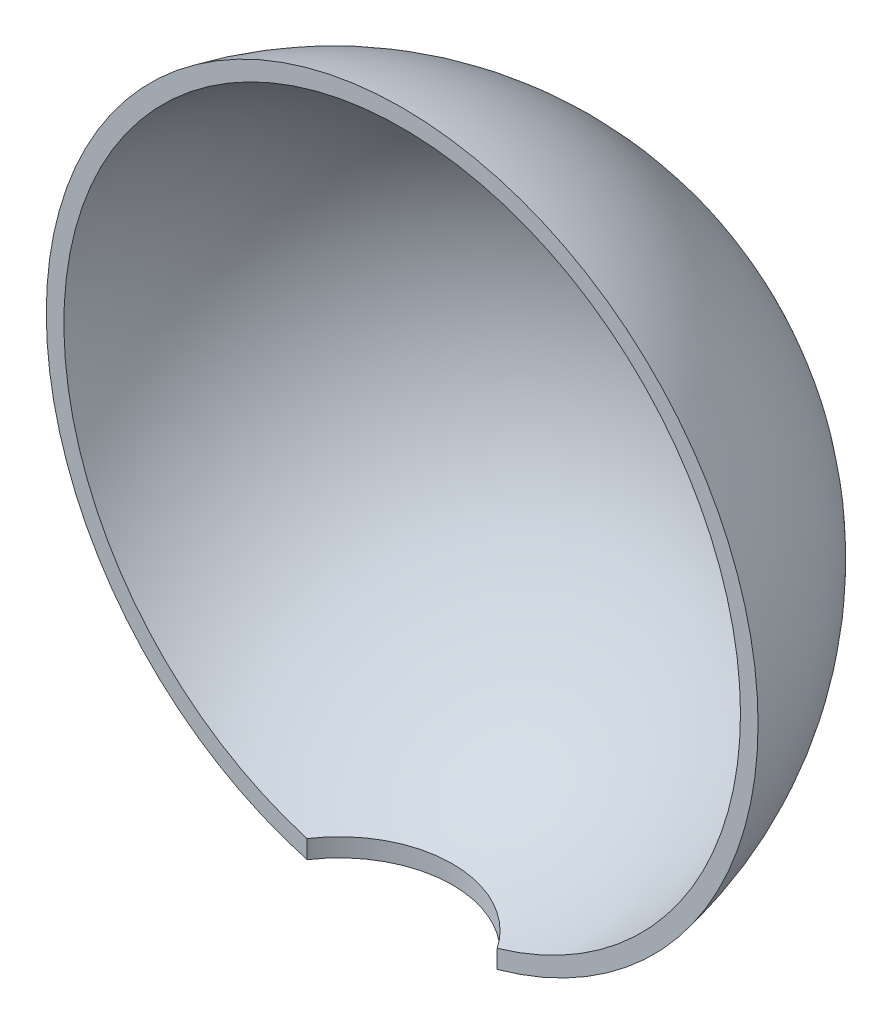
ISO-10303-21;
HEADER;
FILE_DESCRIPTION(('STEP AP214'),'2;1');
FILE_NAME('part.step','',(''),(''),'','','');
FILE_SCHEMA(('AUTOMOTIVE_DESIGN { 1 0 10303 214 1 1 1 1 }'));
ENDSEC;
DATA;
#1=APPLICATION_CONTEXT('core data for automotive mechanical design processes');
#2=APPLICATION_PROTOCOL_DEFINITION('international standard','automotive_design',2000,#1);
#3=PRODUCT_CONTEXT('',#1,'mechanical');
#4=PRODUCT('Part','Part','',(#3));
#5=PRODUCT_RELATED_PRODUCT_CATEGORY('part','',(#4));
#6=PRODUCT_DEFINITION_FORMATION('','',#4);
#7=PRODUCT_DEFINITION_CONTEXT('part definition',#1,'design');
#8=PRODUCT_DEFINITION('design','',#6,#7);
#9=PRODUCT_DEFINITION_SHAPE('','',#8);
#10=(LENGTH_UNIT() NAMED_UNIT(*) SI_UNIT(.MILLI.,.METRE.));
#11=(NAMED_UNIT(*) PLANE_ANGLE_UNIT() SI_UNIT($,.RADIAN.));
#12=(NAMED_UNIT(*) SI_UNIT($,.STERADIAN.) SOLID_ANGLE_UNIT());
#13=UNCERTAINTY_MEASURE_WITH_UNIT(LENGTH_MEASURE(1.E-05),#10,'distance_accuracy_value','');
#14=(GEOMETRIC_REPRESENTATION_CONTEXT(3) GLOBAL_UNCERTAINTY_ASSIGNED_CONTEXT((#13)) GLOBAL_UNIT_ASSIGNED_CONTEXT((#10,
#11,#12)) REPRESENTATION_CONTEXT('',''));
#15=CARTESIAN_POINT('',(0.,0.,0.));
#16=DIRECTION('',(0.,0.,1.));
#17=DIRECTION('',(1.,0.,0.));
#18=AXIS2_PLACEMENT_3D('',#15,#16,#17);
#19=CARTESIAN_POINT('',(0.,0.,0.364161849710984));
#20=DIRECTION('',(0.,0.,-1.));
#21=DIRECTION('',(1.,0.,0.));
#22=AXIS2_PLACEMENT_3D('',#19,#20,#21);
#23=SPHERICAL_SURFACE('',#22,31.5);
#24=CARTESIAN_POINT('',(0.,0.,-5.63583815028902));
#25=DIRECTION('',(0.,0.,-1.));
#26=DIRECTION('',(-1.,0.,0.));
#27=AXIS2_PLACEMENT_3D('',#24,#25,#26);
#28=CIRCLE('',#27,30.9232921921325);
#29=CARTESIAN_POINT('',(-8.26058886180318,-29.7995414672148,-5.63583815028902));
#30=VERTEX_POINT('',#29);
#31=CARTESIAN_POINT('',(8.26058886180318,-29.7995414672148,-5.63583815028902));
#32=VERTEX_POINT('',#31);
#33=EDGE_CURVE('E11',#30,#32,#28,.T.);
#34=ORIENTED_EDGE('',*,*,#33,.T.);
#35=CARTESIAN_POINT('',(-8.26072530949958,-29.7995439112915,-5.63563815028902));
#36=CARTESIAN_POINT('',(-8.10225295948843,-29.7967045981544,-5.86798076007139));
#37=CARTESIAN_POINT('',(-7.93393274740625,-29.7939470279699,-6.0936007334938));
#38=CARTESIAN_POINT('',(-7.57890549928367,-29.7886142495373,-6.52986351161916));
#39=CARTESIAN_POINT('',(-7.39219933621591,-29.7860390326408,-6.74050702659364));
#40=CARTESIAN_POINT('',(-7.00182591379631,-29.7810912382669,-7.14517038141933));
#41=CARTESIAN_POINT('',(-6.79817021648044,-29.7787185248545,-7.33920137307074));
#42=CARTESIAN_POINT('',(-6.37524515383609,-29.7741907535124,-7.70942406187851));
#43=CARTESIAN_POINT('',(-6.15597597966975,-29.7720356929187,-7.885615977382));
#44=CARTESIAN_POINT('',(-5.70327072560683,-29.7679577163107,-8.21898794831747));
#45=CARTESIAN_POINT('',(-5.46982803071737,-29.7660349099641,-8.37615902240835));
#46=CARTESIAN_POINT('',(-4.99052942252742,-29.7624364331051,-8.67027526603878));
#47=CARTESIAN_POINT('',(-4.74467350843757,-29.7607607626083,-8.80722043429218));
#48=CARTESIAN_POINT('',(-4.24235025828731,-29.7576689384904,-9.05988352297611));
#49=CARTESIAN_POINT('',(-3.98588519960018,-29.7562527295236,-9.17560597042238));
#50=CARTESIAN_POINT('',(-3.46411877732719,-29.7536895770892,-9.38503627988158));
#51=CARTESIAN_POINT('',(-3.19881745482608,-29.7525426323699,-9.4787442442359));
#52=CARTESIAN_POINT('',(-2.66127245407182,-29.7505262861093,-9.6434770247413));
#53=CARTESIAN_POINT('',(-2.38902901281365,-29.749656875107,-9.71450261412292));
#54=CARTESIAN_POINT('',(-1.83952577705789,-29.7482017987123,-9.83337001665342));
#55=CARTESIAN_POINT('',(-1.56226597313745,-29.7476161338531,-9.88121178624864));
#56=CARTESIAN_POINT('',(-1.00464989744769,-29.7467326852999,-9.95337777129008));
#57=CARTESIAN_POINT('',(-0.72429306331361,-29.7464349547885,-9.97769764215394));
#58=CARTESIAN_POINT('',(-0.162527351117349,-29.7461297086191,-10.0026314230178));
#59=CARTESIAN_POINT('',(0.118881525862431,-29.7461221926626,-10.0032453574011));
#60=CARTESIAN_POINT('',(0.680724762886148,-29.7463974156688,-9.98076399466954));
#61=CARTESIAN_POINT('',(0.961159209447244,-29.746680128166,-9.95767085936455));
#62=CARTESIAN_POINT('',(1.51908621908441,-29.7475337336433,-9.88794282765073));
#63=CARTESIAN_POINT('',(1.79657877467332,-29.7481046273567,-9.84130787134229));
#64=CARTESIAN_POINT('',(2.34662466550533,-29.7495304230259,-9.72483291456277));
#65=CARTESIAN_POINT('',(2.61917842238615,-29.7503853006157,-9.65499490493149));
#66=CARTESIAN_POINT('',(3.15743092795343,-29.7523729152897,-9.49261028249558));
#67=CARTESIAN_POINT('',(3.4231297496469,-29.7535056494133,-9.40006391165187));
#68=CARTESIAN_POINT('',(3.94583070114979,-29.7560410432895,-9.19290308872542));
#69=CARTESIAN_POINT('',(4.20283135312061,-29.7574437486428,-9.07828490850347));
#70=CARTESIAN_POINT('',(4.706265717005,-29.7605089044867,-8.8278031454248));
#71=CARTESIAN_POINT('',(4.95269930049317,-29.762171358133,-8.69193930445508));
#72=CARTESIAN_POINT('',(5.4332001969212,-29.7657436981796,-8.39996204178301));
#73=CARTESIAN_POINT('',(5.66726953583119,-29.7676535438647,-8.24385195214898));
#74=CARTESIAN_POINT('',(6.12140048571345,-29.7717070237413,-7.91248609614505));
#75=CARTESIAN_POINT('',(6.34146442518697,-29.7738506189087,-7.73723352558396));
#76=CARTESIAN_POINT('',(6.71586426129939,-29.7778236711347,-7.41237244103077));
#77=CARTESIAN_POINT('',(6.87344758538689,-29.7796077341768,-7.26648432690764));
#78=CARTESIAN_POINT('',(7.17889653982589,-29.7832957392708,-6.96487627521989));
#79=CARTESIAN_POINT('',(7.32676290961321,-29.7851996721791,-6.8091570875476));
#80=CARTESIAN_POINT('',(7.61200907935333,-29.7891173680471,-6.488703324562));
#81=CARTESIAN_POINT('',(7.74940015703176,-29.7911310087716,-6.32397878224222));
#82=CARTESIAN_POINT('',(8.01334133319977,-29.7952619192681,-5.98601637340748));
#83=CARTESIAN_POINT('',(8.13988950583639,-29.797379207345,-5.81277700310209));
#84=CARTESIAN_POINT('',(8.26072530949958,-29.7995439112915,-5.63563815028902));
#85=B_SPLINE_CURVE_WITH_KNOTS('',3,(#35,#36,#37,#38,#39,#40,#41,#42,#43,#44,#45,#46,#47,#48,#49,
#50,#51,#52,#53,#54,#55,#56,#57,#58,#59,#60,#61,#62,#63,#64,#65,#66,#67,#68,#69,#70,#71,#72,#73,
#74,#75,#76,#77,#78,#79,#80,#81,#82,#83,#84),.UNSPECIFIED.,.F.,.F.,(4,2,2,2,2,2,2,2,2,2,2,2,2,2,
2,2,2,2,2,2,2,2,2,2,4),(0.,0.843508932453777,1.68697783404349,2.5298760109372,3.37276386966003,
4.21604818657379,5.05933255711171,5.90243683701604,6.74553719740247,7.5886088138612,
8.43168201412727,9.27491090343412,10.1181389254205,10.9612900616192,11.8044433431354,
12.6475243001276,13.4905962743587,14.3338107765963,15.1770355238213,16.0201216712739,
16.8630672812568,17.5069075449553,18.1506987571536,18.7937867772642,19.4369887831264),.UNSPECIFIED.);
#86=EDGE_CURVE('E77',#30,#32,#85,.T.);
#87=ORIENTED_EDGE('',*,*,#86,.F.);
#88=EDGE_LOOP('',(#34,#87));
#89=FACE_BOUND('',#88,.T.);
#90=ADVANCED_FACE('F41',(#89),#23,.T.);
#91=CARTESIAN_POINT('',(0.,0.,-5.63583815028902));
#92=DIRECTION('',(0.,0.,-1.));
#93=DIRECTION('',(-1.,0.,0.));
#94=AXIS2_PLACEMENT_3D('',#91,#92,#93);
#95=PLANE('',#94);
#96=ORIENTED_EDGE('',*,*,#33,.F.);
#97=DIRECTION('',(0.,1.,0.));
#98=VECTOR('',#97,1.);
#99=CARTESIAN_POINT('',(-8.26058886180319,-30.9242921921325,-5.63583815028902));
#100=LINE('',#99,#98);
#101=CARTESIAN_POINT('',(-8.26058886180319,-28.2092657057261,-5.63583815028902));
#102=VERTEX_POINT('',#101);
#103=EDGE_CURVE('E61',#102,#30,#100,.F.);
#104=ORIENTED_EDGE('',*,*,#103,.F.);
#105=CARTESIAN_POINT('',(0.,0.,-5.63583815028902));
#106=DIRECTION('',(0.,0.,-1.));
#107=DIRECTION('',(-1.,0.,0.));
#108=AXIS2_PLACEMENT_3D('',#105,#106,#107);
#109=CIRCLE('',#108,29.3938769133981);
#110=CARTESIAN_POINT('',(8.26058886180319,-28.2092657057261,-5.63583815028902));
#111=VERTEX_POINT('',#110);
#112=EDGE_CURVE('E49',#102,#111,#109,.T.);
#113=ORIENTED_EDGE('',*,*,#112,.T.);
#114=DIRECTION('',(0.,1.,0.));
#115=VECTOR('',#114,1.);
#116=CARTESIAN_POINT('',(8.26058886180319,-30.9242921921325,-5.63583815028902));
#117=LINE('',#116,#115);
#118=EDGE_CURVE('E56',#32,#111,#117,.T.);
#119=ORIENTED_EDGE('',*,*,#118,.F.);
#120=EDGE_LOOP('',(#96,#104,#113,#119));
#121=FACE_BOUND('',#120,.T.);
#122=ADVANCED_FACE('F75',(#121),#95,.F.);
#123=CARTESIAN_POINT('',(0.,0.,0.364161849710984));
#124=DIRECTION('',(0.,0.,-1.));
#125=DIRECTION('',(1.,0.,0.));
#126=AXIS2_PLACEMENT_3D('',#123,#124,#125);
#127=SPHERICAL_SURFACE('',#126,30.);
#128=CARTESIAN_POINT('',(-8.26072530949958,-28.2092682875858,-5.63563815028902));
#129=CARTESIAN_POINT('',(-8.1022535230856,-28.2062689212744,-5.86797993285887));
#130=CARTESIAN_POINT('',(-7.93393388900005,-28.2033558542732,-6.09359920976477));
#131=CARTESIAN_POINT('',(-7.57890776436505,-28.197722278013,-6.52986084892028));
#132=CARTESIAN_POINT('',(-7.39220214598383,-28.1950017596306,-6.74050392077439));
#133=CARTESIAN_POINT('',(-7.00182967185836,-28.1897747197397,-7.14516667896023));
#134=CARTESIAN_POINT('',(-6.79817437285866,-28.1872680547437,-7.33919751178373));
#135=CARTESIAN_POINT('',(-6.37524997762622,-28.1824846054202,-7.70942006201174));
#136=CARTESIAN_POINT('',(-6.15598107273844,-28.1802078182764,-7.88561199796812));
#137=CARTESIAN_POINT('',(-5.70327614394618,-28.1758994501132,-8.21898418724557));
#138=CARTESIAN_POINT('',(-5.4698335017739,-28.1738679849882,-8.37615545494821));
#139=CARTESIAN_POINT('',(-4.99053481592226,-28.170066117572,-8.67027216664272));
#140=CARTESIAN_POINT('',(-4.7446787715266,-28.1682957152959,-8.80721760946748));
#141=CARTESIAN_POINT('',(-4.24235510205718,-28.1650290711017,-9.05988126412057));
#142=CARTESIAN_POINT('',(-3.98588975555565,-28.1635327706852,-9.17560400526233));
#143=CARTESIAN_POINT('',(-3.46412258655807,-28.1608246444448,-9.38503488736084));
#144=CARTESIAN_POINT('',(-3.19882080519678,-28.1596128172968,-9.47874313078159));
#145=CARTESIAN_POINT('',(-2.66127631583571,-28.157482401977,-9.64347592800423));
#146=CARTESIAN_POINT('',(-2.38903388556004,-28.1565638020918,-9.71450138790469));
#147=CARTESIAN_POINT('',(-1.83953260851772,-28.1550263944009,-9.83336871103865));
#148=CARTESIAN_POINT('',(-1.5622737523448,-28.1544075871574,-9.88121053079593));
#149=CARTESIAN_POINT('',(-1.00465951705265,-28.1534741408362,-9.95337677504803));
#150=CARTESIAN_POINT('',(-0.724303575541711,-28.1531595579515,-9.97769685485817));
#151=CARTESIAN_POINT('',(-0.162539609815068,-28.152837029463,-10.0026311996205));
#152=CARTESIAN_POINT('',(0.118868413315533,-28.152829083543,-10.0032454890157));
#153=CARTESIAN_POINT('',(0.680708567071676,-28.1531198707151,-9.98076503573039));
#154=CARTESIAN_POINT('',(0.961140788928705,-28.1534185743199,-9.95767257269311));
#155=CARTESIAN_POINT('',(1.51906339427733,-28.1543204632773,-9.88794626899604));
#156=CARTESIAN_POINT('',(1.79655377029446,-28.1549236494034,-9.84131236853816));
#157=CARTESIAN_POINT('',(2.34659535325713,-28.1564300888415,-9.72483991903693));
#158=CARTESIAN_POINT('',(2.61914698206813,-28.1573333163955,-9.65500336190096));
#159=CARTESIAN_POINT('',(3.15739532205496,-28.1594333329512,-9.49262205246024));
#160=CARTESIAN_POINT('',(3.42309210621675,-28.1606301188258,-9.4000775420455));
#161=CARTESIAN_POINT('',(3.94578921421842,-28.1633088582042,-9.19292081991533));
#162=CARTESIAN_POINT('',(4.2027880566075,-28.1647908600018,-9.0783048709671));
#163=CARTESIAN_POINT('',(4.70621895945056,-28.1680292607218,-8.82782798869251));
#164=CARTESIAN_POINT('',(4.9526508914138,-28.1697856629795,-8.69196679712308));
#165=CARTESIAN_POINT('',(5.43314872632203,-28.173559840686,-8.39999524063502));
#166=CARTESIAN_POINT('',(5.66721665350144,-28.175577573162,-8.24388820491592));
#167=CARTESIAN_POINT('',(6.12134504763398,-28.1798599787786,-7.91252888013544));
#168=CARTESIAN_POINT('',(6.3414078426867,-28.182124610706,-7.73727978632008));
#169=CARTESIAN_POINT('',(6.71581275499283,-28.1863220162908,-7.41241929796853));
#170=CARTESIAN_POINT('',(6.87340184788723,-28.188206852289,-7.26652778140401));
#171=CARTESIAN_POINT('',(7.17886172487344,-28.1921031355723,-6.96491235945499));
#172=CARTESIAN_POINT('',(7.32673324834078,-28.1941145732017,-6.809189203897));
#173=CARTESIAN_POINT('',(7.6119890600879,-28.1982534344712,-6.48872701895341));
#174=CARTESIAN_POINT('',(7.74938462705791,-28.2003807290208,-6.3239980233217));
#175=CARTESIAN_POINT('',(8.01333409200477,-28.2047447446598,-5.98602629037055));
#176=CARTESIAN_POINT('',(8.13988606438609,-28.2069814850742,-5.81278204948173));
#177=CARTESIAN_POINT('',(8.26072530949958,-28.2092682875858,-5.63563815028902));
#178=B_SPLINE_CURVE_WITH_KNOTS('',3,(#128,#129,#130,#131,#132,#133,#134,#135,#136,#137,#138,
#139,#140,#141,#142,#143,#144,#145,#146,#147,#148,#149,#150,#151,#152,#153,#154,#155,#156,#157,
#158,#159,#160,#161,#162,#163,#164,#165,#166,#167,#168,#169,#170,#171,#172,#173,#174,#175,#176,
#177),.UNSPECIFIED.,.F.,.F.,(4,2,2,2,2,2,2,2,2,2,2,2,2,2,2,2,2,2,2,2,2,2,2,2,4),(0.,
0.843510923472319,1.68698185292757,2.52988232025706,3.37277245960682,4.21605924988537,
5.05934608882509,5.90245274492833,6.74555547680905,7.58862452544451,8.43169515507905,
9.27492147799642,10.1181469314628,10.9612913078959,11.8044378260279,12.6475119802056,
13.4905771541657,14.3337852053399,15.1770035067886,16.0200833259384,16.8630226302847,
17.506885064908,18.1506984534579,18.7938086102441,19.4370327342753),.UNSPECIFIED.);
#179=EDGE_CURVE('E66',#102,#111,#178,.T.);
#180=ORIENTED_EDGE('',*,*,#179,.T.);
#181=ORIENTED_EDGE('',*,*,#112,.F.);
#182=EDGE_LOOP('',(#180,#181));
#183=FACE_BOUND('',#182,.T.);
#184=ADVANCED_FACE('F79',(#183),#127,.F.);
#185=CARTESIAN_POINT('',(0.,-30.9242921921325,0.));
#186=DIRECTION('',(0.,1.,0.));
#187=DIRECTION('',(0.,0.,1.));
#188=AXIS2_PLACEMENT_3D('',#185,#186,#187);
#189=CYLINDRICAL_SURFACE('',#188,10.);
#190=ORIENTED_EDGE('',*,*,#86,.T.);
#191=ORIENTED_EDGE('',*,*,#118,.T.);
#192=ORIENTED_EDGE('',*,*,#179,.F.);
#193=ORIENTED_EDGE('',*,*,#103,.T.);
#194=EDGE_LOOP('',(#190,#191,#192,#193));
#195=FACE_BOUND('',#194,.T.);
#196=ADVANCED_FACE('F67',(#195),#189,.F.);
#197=CLOSED_SHELL('',(#90,#122,#184,#196));
#198=MANIFOLD_SOLID_BREP('B2',#197);
#199=ADVANCED_BREP_SHAPE_REPRESENTATION('',(#18,#198),#14);
#200=SHAPE_DEFINITION_REPRESENTATION(#9,#199);
ENDSEC;
END-ISO-10303-21;
